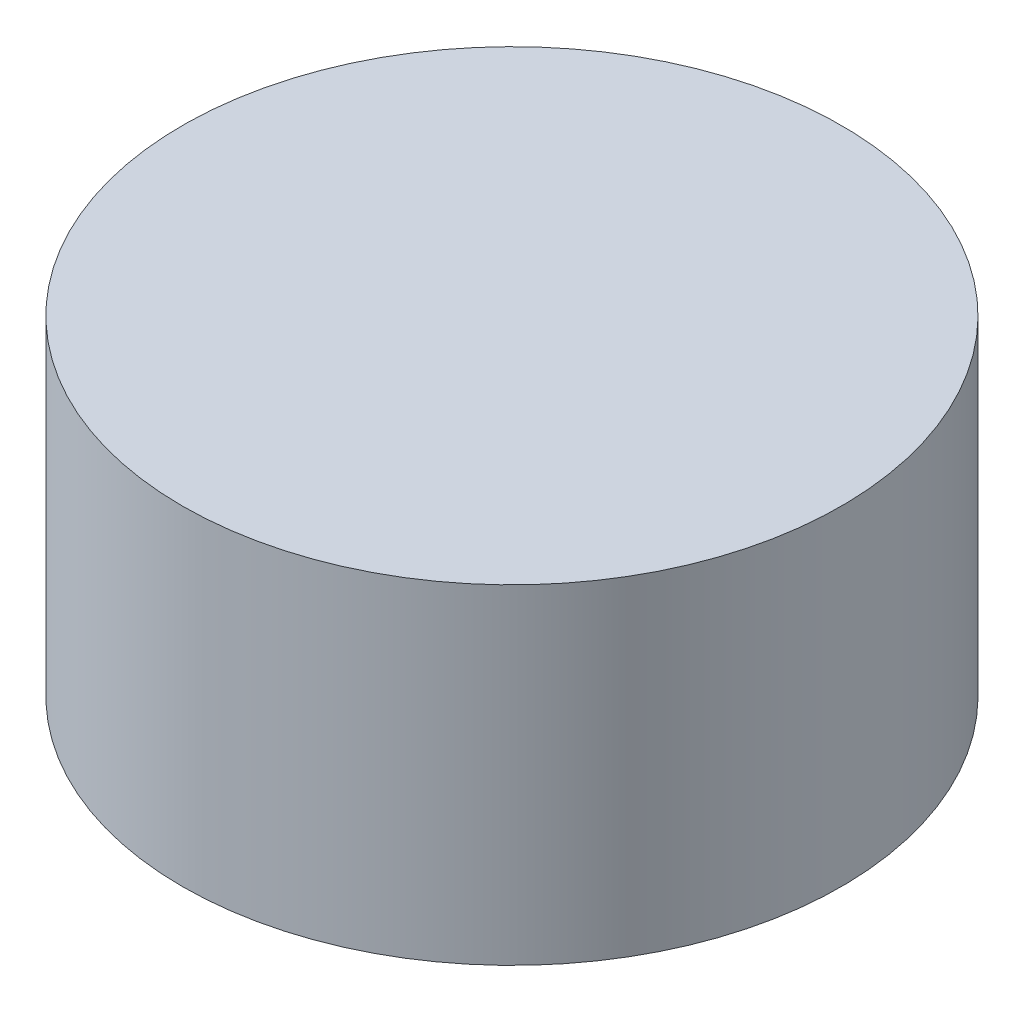
ISO-10303-21;
HEADER;
FILE_DESCRIPTION(('STEP AP214'),'2;1');
FILE_NAME('part.step','',(''),(''),'','','');
FILE_SCHEMA(('AUTOMOTIVE_DESIGN { 1 0 10303 214 1 1 1 1 }'));
ENDSEC;
DATA;
#1=APPLICATION_CONTEXT('core data for automotive mechanical design processes');
#2=APPLICATION_PROTOCOL_DEFINITION('international standard','automotive_design',2000,#1);
#3=PRODUCT_CONTEXT('',#1,'mechanical');
#4=PRODUCT('Part','Part','',(#3));
#5=PRODUCT_RELATED_PRODUCT_CATEGORY('part','',(#4));
#6=PRODUCT_DEFINITION_FORMATION('','',#4);
#7=PRODUCT_DEFINITION_CONTEXT('part definition',#1,'design');
#8=PRODUCT_DEFINITION('design','',#6,#7);
#9=PRODUCT_DEFINITION_SHAPE('','',#8);
#10=(LENGTH_UNIT() NAMED_UNIT(*) SI_UNIT(.MILLI.,.METRE.));
#11=(NAMED_UNIT(*) PLANE_ANGLE_UNIT() SI_UNIT($,.RADIAN.));
#12=(NAMED_UNIT(*) SI_UNIT($,.STERADIAN.) SOLID_ANGLE_UNIT());
#13=UNCERTAINTY_MEASURE_WITH_UNIT(LENGTH_MEASURE(1.E-05),#10,'distance_accuracy_value','');
#14=(GEOMETRIC_REPRESENTATION_CONTEXT(3) GLOBAL_UNCERTAINTY_ASSIGNED_CONTEXT((#13)) GLOBAL_UNIT_ASSIGNED_CONTEXT((#10,
#11,#12)) REPRESENTATION_CONTEXT('',''));
#15=CARTESIAN_POINT('',(0.,0.,0.));
#16=DIRECTION('',(0.,0.,1.));
#17=DIRECTION('',(1.,0.,0.));
#18=AXIS2_PLACEMENT_3D('',#15,#16,#17);
#19=CARTESIAN_POINT('',(0.,5.,0.));
#20=DIRECTION('',(0.,-1.,0.));
#21=DIRECTION('',(0.,0.,-1.));
#22=AXIS2_PLACEMENT_3D('',#19,#20,#21);
#23=CYLINDRICAL_SURFACE('',#22,5.);
#24=CARTESIAN_POINT('',(0.,5.,0.));
#25=DIRECTION('',(0.,1.,0.));
#26=DIRECTION('',(0.,0.,1.));
#27=AXIS2_PLACEMENT_3D('',#24,#25,#26);
#28=CIRCLE('',#27,5.);
#29=CARTESIAN_POINT('',(0.,5.,5.));
#30=VERTEX_POINT('',#29);
#31=EDGE_CURVE('E10',#30,#30,#28,.T.);
#32=ORIENTED_EDGE('',*,*,#31,.F.);
#33=EDGE_LOOP('',(#32));
#34=FACE_BOUND('',#33,.T.);
#35=CARTESIAN_POINT('',(0.,0.,0.));
#36=DIRECTION('',(0.,1.,0.));
#37=DIRECTION('',(0.,0.,1.));
#38=AXIS2_PLACEMENT_3D('',#35,#36,#37);
#39=CIRCLE('',#38,5.);
#40=CARTESIAN_POINT('',(0.,0.,5.));
#41=VERTEX_POINT('',#40);
#42=EDGE_CURVE('E35',#41,#41,#39,.T.);
#43=ORIENTED_EDGE('',*,*,#42,.T.);
#44=EDGE_LOOP('',(#43));
#45=FACE_BOUND('',#44,.T.);
#46=ADVANCED_FACE('F32',(#34,#45),#23,.T.);
#47=CARTESIAN_POINT('',(0.,5.,0.));
#48=DIRECTION('',(0.,1.,0.));
#49=DIRECTION('',(0.,0.,1.));
#50=AXIS2_PLACEMENT_3D('',#47,#48,#49);
#51=PLANE('',#50);
#52=ORIENTED_EDGE('',*,*,#31,.T.);
#53=EDGE_LOOP('',(#52));
#54=FACE_BOUND('',#53,.T.);
#55=ADVANCED_FACE('F47',(#54),#51,.T.);
#56=CARTESIAN_POINT('',(0.,0.,0.));
#57=DIRECTION('',(0.,1.,0.));
#58=DIRECTION('',(0.,0.,1.));
#59=AXIS2_PLACEMENT_3D('',#56,#57,#58);
#60=PLANE('',#59);
#61=ORIENTED_EDGE('',*,*,#42,.F.);
#62=EDGE_LOOP('',(#61));
#63=FACE_BOUND('',#62,.T.);
#64=ADVANCED_FACE('F45',(#63),#60,.F.);
#65=CLOSED_SHELL('',(#46,#55,#64));
#66=MANIFOLD_SOLID_BREP('B2',#65);
#67=ADVANCED_BREP_SHAPE_REPRESENTATION('',(#18,#66),#14);
#68=SHAPE_DEFINITION_REPRESENTATION(#9,#67);
ENDSEC;
END-ISO-10303-21;
